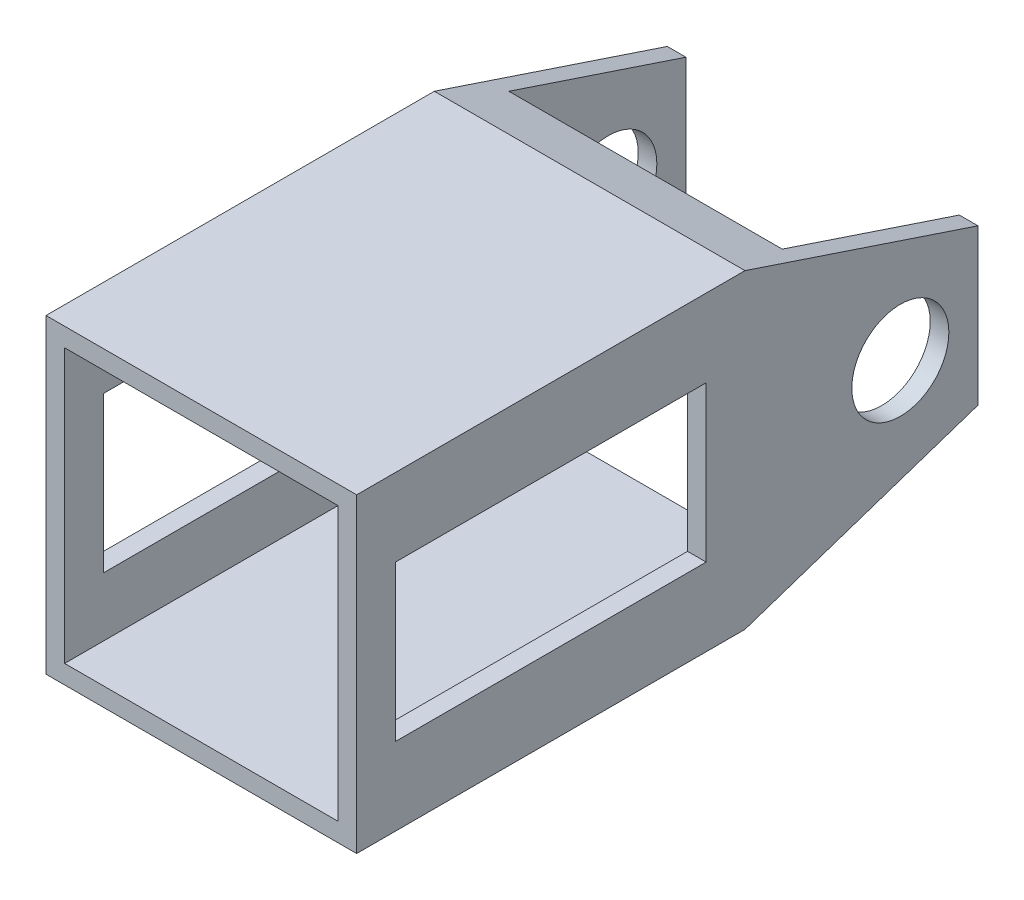
ISO-10303-21;
HEADER;
FILE_DESCRIPTION(('STEP AP214'),'2;1');
FILE_NAME('part.step','',(''),(''),'','','');
FILE_SCHEMA(('AUTOMOTIVE_DESIGN { 1 0 10303 214 1 1 1 1 }'));
ENDSEC;
DATA;
#1=APPLICATION_CONTEXT('core data for automotive mechanical design processes');
#2=APPLICATION_PROTOCOL_DEFINITION('international standard','automotive_design',2000,#1);
#3=PRODUCT_CONTEXT('',#1,'mechanical');
#4=PRODUCT('Part','Part','',(#3));
#5=PRODUCT_RELATED_PRODUCT_CATEGORY('part','',(#4));
#6=PRODUCT_DEFINITION_FORMATION('','',#4);
#7=PRODUCT_DEFINITION_CONTEXT('part definition',#1,'design');
#8=PRODUCT_DEFINITION('design','',#6,#7);
#9=PRODUCT_DEFINITION_SHAPE('','',#8);
#10=(LENGTH_UNIT() NAMED_UNIT(*) SI_UNIT(.MILLI.,.METRE.));
#11=(NAMED_UNIT(*) PLANE_ANGLE_UNIT() SI_UNIT($,.RADIAN.));
#12=(NAMED_UNIT(*) SI_UNIT($,.STERADIAN.) SOLID_ANGLE_UNIT());
#13=UNCERTAINTY_MEASURE_WITH_UNIT(LENGTH_MEASURE(1.E-05),#10,'distance_accuracy_value','');
#14=(GEOMETRIC_REPRESENTATION_CONTEXT(3) GLOBAL_UNCERTAINTY_ASSIGNED_CONTEXT((#13)) GLOBAL_UNIT_ASSIGNED_CONTEXT((#10,
#11,#12)) REPRESENTATION_CONTEXT('',''));
#15=CARTESIAN_POINT('',(0.,0.,0.));
#16=DIRECTION('',(0.,0.,1.));
#17=DIRECTION('',(1.,0.,0.));
#18=AXIS2_PLACEMENT_3D('',#15,#16,#17);
#19=CARTESIAN_POINT('',(0.,0.,-25.4));
#20=DIRECTION('',(0.,0.,-1.));
#21=DIRECTION('',(-1.,0.,0.));
#22=AXIS2_PLACEMENT_3D('',#19,#20,#21);
#23=PLANE('',#22);
#24=DIRECTION('',(1.,0.,0.));
#25=VECTOR('',#24,1.);
#26=CARTESIAN_POINT('',(-12.7,6.35,-25.4));
#27=LINE('',#26,#25);
#28=CARTESIAN_POINT('',(11.176,6.35,-25.4));
#29=VERTEX_POINT('',#28);
#30=CARTESIAN_POINT('',(12.7,6.35,-25.4));
#31=VERTEX_POINT('',#30);
#32=EDGE_CURVE('E200',#29,#31,#27,.T.);
#33=ORIENTED_EDGE('',*,*,#32,.T.);
#34=DIRECTION('',(0.,1.,0.));
#35=VECTOR('',#34,1.);
#36=CARTESIAN_POINT('',(12.7,-12.7,-25.4));
#37=LINE('',#36,#35);
#38=CARTESIAN_POINT('',(12.7,-6.35,-25.4));
#39=VERTEX_POINT('',#38);
#40=EDGE_CURVE('E277',#39,#31,#37,.T.);
#41=ORIENTED_EDGE('',*,*,#40,.F.);
#42=DIRECTION('',(1.,0.,0.));
#43=VECTOR('',#42,1.);
#44=CARTESIAN_POINT('',(-12.7,-6.35,-25.4));
#45=LINE('',#44,#43);
#46=CARTESIAN_POINT('',(11.176,-6.35,-25.4));
#47=VERTEX_POINT('',#46);
#48=EDGE_CURVE('E316',#47,#39,#45,.T.);
#49=ORIENTED_EDGE('',*,*,#48,.F.);
#50=DIRECTION('',(0.,1.,0.));
#51=VECTOR('',#50,1.);
#52=CARTESIAN_POINT('',(11.176,-11.176,-25.4));
#53=LINE('',#52,#51);
#54=EDGE_CURVE('E251',#47,#29,#53,.T.);
#55=ORIENTED_EDGE('',*,*,#54,.T.);
#56=EDGE_LOOP('',(#33,#41,#49,#55));
#57=FACE_BOUND('',#56,.T.);
#58=ADVANCED_FACE('F42',(#57),#23,.T.);
#59=CARTESIAN_POINT('',(0.,0.,25.4));
#60=DIRECTION('',(0.,0.,-1.));
#61=DIRECTION('',(-1.,0.,0.));
#62=AXIS2_PLACEMENT_3D('',#59,#60,#61);
#63=PLANE('',#62);
#64=DIRECTION('',(0.,1.,0.));
#65=VECTOR('',#64,1.);
#66=CARTESIAN_POINT('',(12.7,-12.7,25.4));
#67=LINE('',#66,#65);
#68=CARTESIAN_POINT('',(12.7,-12.7,25.4));
#69=VERTEX_POINT('',#68);
#70=CARTESIAN_POINT('',(12.7,12.7,25.4));
#71=VERTEX_POINT('',#70);
#72=EDGE_CURVE('E278',#69,#71,#67,.T.);
#73=ORIENTED_EDGE('',*,*,#72,.T.);
#74=DIRECTION('',(-1.,0.,0.));
#75=VECTOR('',#74,1.);
#76=CARTESIAN_POINT('',(-12.7,12.7,25.4));
#77=LINE('',#76,#75);
#78=CARTESIAN_POINT('',(-12.7,12.7,25.4));
#79=VERTEX_POINT('',#78);
#80=EDGE_CURVE('E282',#71,#79,#77,.T.);
#81=ORIENTED_EDGE('',*,*,#80,.T.);
#82=DIRECTION('',(0.,-1.,0.));
#83=VECTOR('',#82,1.);
#84=CARTESIAN_POINT('',(-12.7,-12.7,25.4));
#85=LINE('',#84,#83);
#86=CARTESIAN_POINT('',(-12.7,-12.7,25.4));
#87=VERTEX_POINT('',#86);
#88=EDGE_CURVE('E204',#79,#87,#85,.T.);
#89=ORIENTED_EDGE('',*,*,#88,.T.);
#90=DIRECTION('',(1.,0.,0.));
#91=VECTOR('',#90,1.);
#92=CARTESIAN_POINT('',(-12.7,-12.7,25.4));
#93=LINE('',#92,#91);
#94=EDGE_CURVE('E288',#87,#69,#93,.T.);
#95=ORIENTED_EDGE('',*,*,#94,.T.);
#96=EDGE_LOOP('',(#73,#81,#89,#95));
#97=FACE_BOUND('',#96,.T.);
#98=DIRECTION('',(0.,1.,0.));
#99=VECTOR('',#98,1.);
#100=CARTESIAN_POINT('',(11.176,-11.176,25.4));
#101=LINE('',#100,#99);
#102=CARTESIAN_POINT('',(11.176,-11.176,25.4));
#103=VERTEX_POINT('',#102);
#104=CARTESIAN_POINT('',(11.176,11.176,25.4));
#105=VERTEX_POINT('',#104);
#106=EDGE_CURVE('E402',#103,#105,#101,.T.);
#107=ORIENTED_EDGE('',*,*,#106,.F.);
#108=DIRECTION('',(1.,0.,0.));
#109=VECTOR('',#108,1.);
#110=CARTESIAN_POINT('',(-11.176,-11.176,25.4));
#111=LINE('',#110,#109);
#112=CARTESIAN_POINT('',(-11.176,-11.176,25.4));
#113=VERTEX_POINT('',#112);
#114=EDGE_CURVE('E256',#113,#103,#111,.T.);
#115=ORIENTED_EDGE('',*,*,#114,.F.);
#116=DIRECTION('',(0.,-1.,0.));
#117=VECTOR('',#116,1.);
#118=CARTESIAN_POINT('',(-11.176,-11.176,25.4));
#119=LINE('',#118,#117);
#120=CARTESIAN_POINT('',(-11.176,11.176,25.4));
#121=VERTEX_POINT('',#120);
#122=EDGE_CURVE('E264',#121,#113,#119,.T.);
#123=ORIENTED_EDGE('',*,*,#122,.F.);
#124=DIRECTION('',(-1.,0.,0.));
#125=VECTOR('',#124,1.);
#126=CARTESIAN_POINT('',(-11.176,11.176,25.4));
#127=LINE('',#126,#125);
#128=EDGE_CURVE('E405',#105,#121,#127,.T.);
#129=ORIENTED_EDGE('',*,*,#128,.F.);
#130=EDGE_LOOP('',(#107,#115,#123,#129));
#131=FACE_BOUND('',#130,.T.);
#132=ADVANCED_FACE('F426',(#97,#131),#63,.F.);
#133=CARTESIAN_POINT('',(-12.7,6.35,-25.4));
#134=VERTEX_POINT('',#133);
#135=CARTESIAN_POINT('',(-11.176,6.35,-25.4));
#136=VERTEX_POINT('',#135);
#137=EDGE_CURVE('E183',#134,#136,#27,.T.);
#138=ORIENTED_EDGE('',*,*,#137,.T.);
#139=DIRECTION('',(0.,-1.,0.));
#140=VECTOR('',#139,1.);
#141=CARTESIAN_POINT('',(-11.176,-11.176,-25.4));
#142=LINE('',#141,#140);
#143=CARTESIAN_POINT('',(-11.176,-6.35,-25.4));
#144=VERTEX_POINT('',#143);
#145=EDGE_CURVE('E267',#136,#144,#142,.T.);
#146=ORIENTED_EDGE('',*,*,#145,.T.);
#147=CARTESIAN_POINT('',(-12.7,-6.35,-25.4));
#148=VERTEX_POINT('',#147);
#149=EDGE_CURVE('E311',#148,#144,#45,.T.);
#150=ORIENTED_EDGE('',*,*,#149,.F.);
#151=DIRECTION('',(0.,-1.,0.));
#152=VECTOR('',#151,1.);
#153=CARTESIAN_POINT('',(-12.7,-12.7,-25.4));
#154=LINE('',#153,#152);
#155=EDGE_CURVE('E283',#134,#148,#154,.T.);
#156=ORIENTED_EDGE('',*,*,#155,.F.);
#157=EDGE_LOOP('',(#138,#146,#150,#156));
#158=FACE_BOUND('',#157,.T.);
#159=ADVANCED_FACE('F418',(#158),#23,.T.);
#160=CARTESIAN_POINT('',(12.7,-12.7,25.4));
#161=DIRECTION('',(-1.,0.,0.));
#162=DIRECTION('',(0.,0.,1.));
#163=AXIS2_PLACEMENT_3D('',#160,#161,#162);
#164=PLANE('',#163);
#165=DIRECTION('',(0.,0.,1.));
#166=VECTOR('',#165,1.);
#167=CARTESIAN_POINT('',(12.7,6.35,22.225));
#168=LINE('',#167,#166);
#169=CARTESIAN_POINT('',(12.7,6.35,-3.175));
#170=VERTEX_POINT('',#169);
#171=CARTESIAN_POINT('',(12.7,6.35,22.225));
#172=VERTEX_POINT('',#171);
#173=EDGE_CURVE('E351',#170,#172,#168,.T.);
#174=ORIENTED_EDGE('',*,*,#173,.F.);
#175=DIRECTION('',(0.,1.,0.));
#176=VECTOR('',#175,1.);
#177=CARTESIAN_POINT('',(12.7,-6.35,-3.175));
#178=LINE('',#177,#176);
#179=CARTESIAN_POINT('',(12.7,-6.35,-3.175));
#180=VERTEX_POINT('',#179);
#181=EDGE_CURVE('E348',#180,#170,#178,.T.);
#182=ORIENTED_EDGE('',*,*,#181,.F.);
#183=DIRECTION('',(0.,0.,-1.));
#184=VECTOR('',#183,1.);
#185=CARTESIAN_POINT('',(12.7,-6.35,22.225));
#186=LINE('',#185,#184);
#187=CARTESIAN_POINT('',(12.7,-6.35,22.225));
#188=VERTEX_POINT('',#187);
#189=EDGE_CURVE('E335',#188,#180,#186,.T.);
#190=ORIENTED_EDGE('',*,*,#189,.F.);
#191=DIRECTION('',(0.,-1.,0.));
#192=VECTOR('',#191,1.);
#193=CARTESIAN_POINT('',(12.7,-6.35,22.225));
#194=LINE('',#193,#192);
#195=EDGE_CURVE('E356',#172,#188,#194,.T.);
#196=ORIENTED_EDGE('',*,*,#195,.F.);
#197=EDGE_LOOP('',(#174,#182,#190,#196));
#198=FACE_BOUND('',#197,.T.);
#199=CARTESIAN_POINT('',(12.7,0.,-19.05));
#200=DIRECTION('',(1.,0.,0.));
#201=DIRECTION('',(0.,0.,-1.));
#202=AXIS2_PLACEMENT_3D('',#199,#200,#201);
#203=CIRCLE('',#202,3.96875);
#204=CARTESIAN_POINT('',(12.7,0.,-23.01875));
#205=VERTEX_POINT('',#204);
#206=EDGE_CURVE('E352',#205,#205,#203,.T.);
#207=ORIENTED_EDGE('',*,*,#206,.F.);
#208=EDGE_LOOP('',(#207));
#209=FACE_BOUND('',#208,.T.);
#210=ORIENTED_EDGE('',*,*,#40,.T.);
#211=DIRECTION('',(0.,-0.316227766016838,-0.948683298050514));
#212=VECTOR('',#211,1.);
#213=CARTESIAN_POINT('',(12.7,12.7,-6.35));
#214=LINE('',#213,#212);
#215=CARTESIAN_POINT('',(12.7,12.7,-6.35));
#216=VERTEX_POINT('',#215);
#217=EDGE_CURVE('E189',#216,#31,#214,.T.);
#218=ORIENTED_EDGE('',*,*,#217,.F.);
#219=DIRECTION('',(0.,0.,-1.));
#220=VECTOR('',#219,1.);
#221=CARTESIAN_POINT('',(12.7,12.7,25.4));
#222=LINE('',#221,#220);
#223=EDGE_CURVE('E198',#71,#216,#222,.T.);
#224=ORIENTED_EDGE('',*,*,#223,.F.);
#225=ORIENTED_EDGE('',*,*,#72,.F.);
#226=DIRECTION('',(0.,0.,-1.));
#227=VECTOR('',#226,1.);
#228=CARTESIAN_POINT('',(12.7,-12.7,25.4));
#229=LINE('',#228,#227);
#230=CARTESIAN_POINT('',(12.7,-12.7,-6.35));
#231=VERTEX_POINT('',#230);
#232=EDGE_CURVE('E213',#69,#231,#229,.T.);
#233=ORIENTED_EDGE('',*,*,#232,.T.);
#234=DIRECTION('',(0.,-0.316227766016838,0.948683298050514));
#235=VECTOR('',#234,1.);
#236=CARTESIAN_POINT('',(12.7,-12.7,-6.35));
#237=LINE('',#236,#235);
#238=EDGE_CURVE('E301',#39,#231,#237,.T.);
#239=ORIENTED_EDGE('',*,*,#238,.F.);
#240=EDGE_LOOP('',(#210,#218,#224,#225,#233,#239));
#241=FACE_BOUND('',#240,.T.);
#242=ADVANCED_FACE('F44',(#198,#209,#241),#164,.F.);
#243=CARTESIAN_POINT('',(-12.7,12.7,25.4));
#244=DIRECTION('',(0.,-1.,0.));
#245=DIRECTION('',(0.,0.,-1.));
#246=AXIS2_PLACEMENT_3D('',#243,#244,#245);
#247=PLANE('',#246);
#248=ORIENTED_EDGE('',*,*,#223,.T.);
#249=DIRECTION('',(1.,0.,0.));
#250=VECTOR('',#249,1.);
#251=CARTESIAN_POINT('',(-12.7,12.7,-6.35));
#252=LINE('',#251,#250);
#253=CARTESIAN_POINT('',(-12.7,12.7,-6.35));
#254=VERTEX_POINT('',#253);
#255=EDGE_CURVE('E180',#254,#216,#252,.T.);
#256=ORIENTED_EDGE('',*,*,#255,.F.);
#257=DIRECTION('',(0.,0.,-1.));
#258=VECTOR('',#257,1.);
#259=CARTESIAN_POINT('',(-12.7,12.7,25.4));
#260=LINE('',#259,#258);
#261=EDGE_CURVE('E195',#79,#254,#260,.T.);
#262=ORIENTED_EDGE('',*,*,#261,.F.);
#263=ORIENTED_EDGE('',*,*,#80,.F.);
#264=EDGE_LOOP('',(#248,#256,#262,#263));
#265=FACE_BOUND('',#264,.T.);
#266=ADVANCED_FACE('F194',(#265),#247,.F.);
#267=CARTESIAN_POINT('',(-12.7,-12.7,25.4));
#268=DIRECTION('',(1.,0.,0.));
#269=DIRECTION('',(0.,1.,0.));
#270=AXIS2_PLACEMENT_3D('',#267,#268,#269);
#271=PLANE('',#270);
#272=DIRECTION('',(0.,0.,-1.));
#273=VECTOR('',#272,1.);
#274=CARTESIAN_POINT('',(-12.7,-6.35,22.225));
#275=LINE('',#274,#273);
#276=CARTESIAN_POINT('',(-12.7,-6.35,22.225));
#277=VERTEX_POINT('',#276);
#278=CARTESIAN_POINT('',(-12.7,-6.35,-3.175));
#279=VERTEX_POINT('',#278);
#280=EDGE_CURVE('E343',#277,#279,#275,.T.);
#281=ORIENTED_EDGE('',*,*,#280,.T.);
#282=DIRECTION('',(0.,1.,0.));
#283=VECTOR('',#282,1.);
#284=CARTESIAN_POINT('',(-12.7,-6.35,-3.175));
#285=LINE('',#284,#283);
#286=CARTESIAN_POINT('',(-12.7,6.35,-3.175));
#287=VERTEX_POINT('',#286);
#288=EDGE_CURVE('E330',#279,#287,#285,.T.);
#289=ORIENTED_EDGE('',*,*,#288,.T.);
#290=DIRECTION('',(0.,0.,1.));
#291=VECTOR('',#290,1.);
#292=CARTESIAN_POINT('',(-12.7,6.35,22.225));
#293=LINE('',#292,#291);
#294=CARTESIAN_POINT('',(-12.7,6.35,22.225));
#295=VERTEX_POINT('',#294);
#296=EDGE_CURVE('E334',#287,#295,#293,.T.);
#297=ORIENTED_EDGE('',*,*,#296,.T.);
#298=DIRECTION('',(0.,-1.,0.));
#299=VECTOR('',#298,1.);
#300=CARTESIAN_POINT('',(-12.7,-6.35,22.225));
#301=LINE('',#300,#299);
#302=EDGE_CURVE('E339',#295,#277,#301,.T.);
#303=ORIENTED_EDGE('',*,*,#302,.T.);
#304=EDGE_LOOP('',(#281,#289,#297,#303));
#305=FACE_BOUND('',#304,.T.);
#306=CARTESIAN_POINT('',(-12.7,0.,-19.05));
#307=DIRECTION('',(1.,0.,0.));
#308=DIRECTION('',(0.,0.,-1.));
#309=AXIS2_PLACEMENT_3D('',#306,#307,#308);
#310=CIRCLE('',#309,3.96875);
#311=CARTESIAN_POINT('',(-12.7,0.,-23.01875));
#312=VERTEX_POINT('',#311);
#313=EDGE_CURVE('E329',#312,#312,#310,.T.);
#314=ORIENTED_EDGE('',*,*,#313,.T.);
#315=EDGE_LOOP('',(#314));
#316=FACE_BOUND('',#315,.T.);
#317=ORIENTED_EDGE('',*,*,#261,.T.);
#318=DIRECTION('',(0.,-0.316227766016838,-0.948683298050514));
#319=VECTOR('',#318,1.);
#320=CARTESIAN_POINT('',(-12.7,12.7,-6.35));
#321=LINE('',#320,#319);
#322=EDGE_CURVE('E177',#254,#134,#321,.T.);
#323=ORIENTED_EDGE('',*,*,#322,.T.);
#324=ORIENTED_EDGE('',*,*,#155,.T.);
#325=DIRECTION('',(0.,-0.316227766016838,0.948683298050514));
#326=VECTOR('',#325,1.);
#327=CARTESIAN_POINT('',(-12.7,-12.7,-6.35));
#328=LINE('',#327,#326);
#329=CARTESIAN_POINT('',(-12.7,-12.7,-6.35));
#330=VERTEX_POINT('',#329);
#331=EDGE_CURVE('E310',#148,#330,#328,.T.);
#332=ORIENTED_EDGE('',*,*,#331,.T.);
#333=DIRECTION('',(0.,0.,-1.));
#334=VECTOR('',#333,1.);
#335=CARTESIAN_POINT('',(-12.7,-12.7,25.4));
#336=LINE('',#335,#334);
#337=EDGE_CURVE('E206',#87,#330,#336,.T.);
#338=ORIENTED_EDGE('',*,*,#337,.F.);
#339=ORIENTED_EDGE('',*,*,#88,.F.);
#340=EDGE_LOOP('',(#317,#323,#324,#332,#338,#339));
#341=FACE_BOUND('',#340,.T.);
#342=ADVANCED_FACE('F202',(#305,#316,#341),#271,.F.);
#343=CARTESIAN_POINT('',(-12.7,-12.7,25.4));
#344=DIRECTION('',(0.,1.,0.));
#345=DIRECTION('',(0.,0.,1.));
#346=AXIS2_PLACEMENT_3D('',#343,#344,#345);
#347=PLANE('',#346);
#348=ORIENTED_EDGE('',*,*,#337,.T.);
#349=DIRECTION('',(1.,0.,0.));
#350=VECTOR('',#349,1.);
#351=CARTESIAN_POINT('',(-12.7,-12.7,-6.35));
#352=LINE('',#351,#350);
#353=EDGE_CURVE('E307',#330,#231,#352,.T.);
#354=ORIENTED_EDGE('',*,*,#353,.T.);
#355=ORIENTED_EDGE('',*,*,#232,.F.);
#356=ORIENTED_EDGE('',*,*,#94,.F.);
#357=EDGE_LOOP('',(#348,#354,#355,#356));
#358=FACE_BOUND('',#357,.T.);
#359=ADVANCED_FACE('F306',(#358),#347,.F.);
#360=CARTESIAN_POINT('',(11.176,-11.176,25.4));
#361=DIRECTION('',(-1.,0.,0.));
#362=DIRECTION('',(0.,0.,1.));
#363=AXIS2_PLACEMENT_3D('',#360,#361,#362);
#364=PLANE('',#363);
#365=DIRECTION('',(0.,0.316227766016838,0.948683298050514));
#366=VECTOR('',#365,1.);
#367=CARTESIAN_POINT('',(11.176,19.8374,15.0622));
#368=LINE('',#367,#366);
#369=CARTESIAN_POINT('',(11.176,11.176,-10.922));
#370=VERTEX_POINT('',#369);
#371=EDGE_CURVE('E326',#29,#370,#368,.T.);
#372=ORIENTED_EDGE('',*,*,#371,.F.);
#373=ORIENTED_EDGE('',*,*,#54,.F.);
#374=DIRECTION('',(0.,0.316227766016838,-0.948683298050514));
#375=VECTOR('',#374,1.);
#376=CARTESIAN_POINT('',(11.176,-22.0726,21.7678));
#377=LINE('',#376,#375);
#378=CARTESIAN_POINT('',(11.176,-11.176,-10.922));
#379=VERTEX_POINT('',#378);
#380=EDGE_CURVE('E237',#379,#47,#377,.T.);
#381=ORIENTED_EDGE('',*,*,#380,.F.);
#382=DIRECTION('',(0.,0.,-1.));
#383=VECTOR('',#382,1.);
#384=CARTESIAN_POINT('',(11.176,-11.176,25.4));
#385=LINE('',#384,#383);
#386=EDGE_CURVE('E248',#103,#379,#385,.T.);
#387=ORIENTED_EDGE('',*,*,#386,.F.);
#388=ORIENTED_EDGE('',*,*,#106,.T.);
#389=DIRECTION('',(0.,0.,-1.));
#390=VECTOR('',#389,1.);
#391=CARTESIAN_POINT('',(11.176,11.176,25.4));
#392=LINE('',#391,#390);
#393=EDGE_CURVE('E273',#105,#370,#392,.T.);
#394=ORIENTED_EDGE('',*,*,#393,.T.);
#395=EDGE_LOOP('',(#372,#373,#381,#387,#388,#394));
#396=FACE_BOUND('',#395,.T.);
#397=DIRECTION('',(0.,-1.,0.));
#398=VECTOR('',#397,1.);
#399=CARTESIAN_POINT('',(11.176,-11.176,-3.175));
#400=LINE('',#399,#398);
#401=CARTESIAN_POINT('',(11.176,6.35,-3.175));
#402=VERTEX_POINT('',#401);
#403=CARTESIAN_POINT('',(11.176,-6.35,-3.175));
#404=VERTEX_POINT('',#403);
#405=EDGE_CURVE('E399',#402,#404,#400,.T.);
#406=ORIENTED_EDGE('',*,*,#405,.F.);
#407=DIRECTION('',(0.,0.,-1.));
#408=VECTOR('',#407,1.);
#409=CARTESIAN_POINT('',(11.176,6.34999999999999,25.4));
#410=LINE('',#409,#408);
#411=CARTESIAN_POINT('',(11.176,6.34999999999999,22.225));
#412=VERTEX_POINT('',#411);
#413=EDGE_CURVE('E389',#412,#402,#410,.T.);
#414=ORIENTED_EDGE('',*,*,#413,.F.);
#415=DIRECTION('',(0.,1.,0.));
#416=VECTOR('',#415,1.);
#417=CARTESIAN_POINT('',(11.176,-11.176,22.225));
#418=LINE('',#417,#416);
#419=CARTESIAN_POINT('',(11.176,-6.35,22.225));
#420=VERTEX_POINT('',#419);
#421=EDGE_CURVE('E392',#420,#412,#418,.T.);
#422=ORIENTED_EDGE('',*,*,#421,.F.);
#423=DIRECTION('',(0.,0.,1.));
#424=VECTOR('',#423,1.);
#425=CARTESIAN_POINT('',(11.176,-6.35,25.4));
#426=LINE('',#425,#424);
#427=EDGE_CURVE('E396',#404,#420,#426,.T.);
#428=ORIENTED_EDGE('',*,*,#427,.F.);
#429=EDGE_LOOP('',(#406,#414,#422,#428));
#430=FACE_BOUND('',#429,.T.);
#431=CARTESIAN_POINT('',(11.176,0.,-19.05));
#432=DIRECTION('',(-1.,0.,0.));
#433=DIRECTION('',(0.,0.,1.));
#434=AXIS2_PLACEMENT_3D('',#431,#432,#433);
#435=CIRCLE('',#434,3.96875);
#436=CARTESIAN_POINT('',(11.176,0.,-15.08125));
#437=VERTEX_POINT('',#436);
#438=EDGE_CURVE('E221',#437,#437,#435,.T.);
#439=ORIENTED_EDGE('',*,*,#438,.F.);
#440=EDGE_LOOP('',(#439));
#441=FACE_BOUND('',#440,.T.);
#442=ADVANCED_FACE('F246',(#396,#430,#441),#364,.T.);
#443=CARTESIAN_POINT('',(-11.176,11.176,25.4));
#444=DIRECTION('',(0.,-1.,0.));
#445=DIRECTION('',(0.,0.,-1.));
#446=AXIS2_PLACEMENT_3D('',#443,#444,#445);
#447=PLANE('',#446);
#448=DIRECTION('',(-1.,0.,0.));
#449=VECTOR('',#448,1.);
#450=CARTESIAN_POINT('',(-11.176,11.176,-10.922));
#451=LINE('',#450,#449);
#452=CARTESIAN_POINT('',(-11.176,11.176,-10.922));
#453=VERTEX_POINT('',#452);
#454=EDGE_CURVE('E57',#370,#453,#451,.T.);
#455=ORIENTED_EDGE('',*,*,#454,.F.);
#456=ORIENTED_EDGE('',*,*,#393,.F.);
#457=ORIENTED_EDGE('',*,*,#128,.T.);
#458=DIRECTION('',(0.,0.,-1.));
#459=VECTOR('',#458,1.);
#460=CARTESIAN_POINT('',(-11.176,11.176,25.4));
#461=LINE('',#460,#459);
#462=EDGE_CURVE('E262',#121,#453,#461,.T.);
#463=ORIENTED_EDGE('',*,*,#462,.T.);
#464=EDGE_LOOP('',(#455,#456,#457,#463));
#465=FACE_BOUND('',#464,.T.);
#466=ADVANCED_FACE('F429',(#465),#447,.T.);
#467=CARTESIAN_POINT('',(-11.176,-11.176,25.4));
#468=DIRECTION('',(1.,0.,0.));
#469=DIRECTION('',(0.,0.,-1.));
#470=AXIS2_PLACEMENT_3D('',#467,#468,#469);
#471=PLANE('',#470);
#472=DIRECTION('',(0.,-0.316227766016838,-0.948683298050514));
#473=VECTOR('',#472,1.);
#474=CARTESIAN_POINT('',(-11.176,19.8374,15.0622));
#475=LINE('',#474,#473);
#476=EDGE_CURVE('E11',#453,#136,#475,.T.);
#477=ORIENTED_EDGE('',*,*,#476,.F.);
#478=ORIENTED_EDGE('',*,*,#462,.F.);
#479=ORIENTED_EDGE('',*,*,#122,.T.);
#480=DIRECTION('',(0.,0.,-1.));
#481=VECTOR('',#480,1.);
#482=CARTESIAN_POINT('',(-11.176,-11.176,25.4));
#483=LINE('',#482,#481);
#484=CARTESIAN_POINT('',(-11.176,-11.176,-10.922));
#485=VERTEX_POINT('',#484);
#486=EDGE_CURVE('E258',#113,#485,#483,.T.);
#487=ORIENTED_EDGE('',*,*,#486,.T.);
#488=DIRECTION('',(0.,-0.316227766016838,0.948683298050514));
#489=VECTOR('',#488,1.);
#490=CARTESIAN_POINT('',(-11.176,-22.0726,21.7678));
#491=LINE('',#490,#489);
#492=EDGE_CURVE('E65',#144,#485,#491,.T.);
#493=ORIENTED_EDGE('',*,*,#492,.F.);
#494=ORIENTED_EDGE('',*,*,#145,.F.);
#495=EDGE_LOOP('',(#477,#478,#479,#487,#493,#494));
#496=FACE_BOUND('',#495,.T.);
#497=DIRECTION('',(0.,1.,0.));
#498=VECTOR('',#497,1.);
#499=CARTESIAN_POINT('',(-11.176,-11.176,-3.175));
#500=LINE('',#499,#498);
#501=CARTESIAN_POINT('',(-11.176,-6.35,-3.175));
#502=VERTEX_POINT('',#501);
#503=CARTESIAN_POINT('',(-11.176,6.34999999999999,-3.175));
#504=VERTEX_POINT('',#503);
#505=EDGE_CURVE('E231',#502,#504,#500,.T.);
#506=ORIENTED_EDGE('',*,*,#505,.F.);
#507=DIRECTION('',(0.,0.,-1.));
#508=VECTOR('',#507,1.);
#509=CARTESIAN_POINT('',(-11.176,-6.35,25.4));
#510=LINE('',#509,#508);
#511=CARTESIAN_POINT('',(-11.176,-6.35,22.225));
#512=VERTEX_POINT('',#511);
#513=EDGE_CURVE('E228',#512,#502,#510,.T.);
#514=ORIENTED_EDGE('',*,*,#513,.F.);
#515=DIRECTION('',(0.,-1.,0.));
#516=VECTOR('',#515,1.);
#517=CARTESIAN_POINT('',(-11.176,-11.176,22.225));
#518=LINE('',#517,#516);
#519=CARTESIAN_POINT('',(-11.176,6.35,22.225));
#520=VERTEX_POINT('',#519);
#521=EDGE_CURVE('E225',#520,#512,#518,.T.);
#522=ORIENTED_EDGE('',*,*,#521,.F.);
#523=DIRECTION('',(0.,0.,1.));
#524=VECTOR('',#523,1.);
#525=CARTESIAN_POINT('',(-11.176,6.34999999999999,25.4));
#526=LINE('',#525,#524);
#527=EDGE_CURVE('E210',#504,#520,#526,.T.);
#528=ORIENTED_EDGE('',*,*,#527,.F.);
#529=EDGE_LOOP('',(#506,#514,#522,#528));
#530=FACE_BOUND('',#529,.T.);
#531=CARTESIAN_POINT('',(-11.176,0.,-19.05));
#532=DIRECTION('',(1.,0.,0.));
#533=DIRECTION('',(0.,0.,-1.));
#534=AXIS2_PLACEMENT_3D('',#531,#532,#533);
#535=CIRCLE('',#534,3.96875);
#536=CARTESIAN_POINT('',(-11.176,0.,-23.01875));
#537=VERTEX_POINT('',#536);
#538=EDGE_CURVE('E217',#537,#537,#535,.T.);
#539=ORIENTED_EDGE('',*,*,#538,.F.);
#540=EDGE_LOOP('',(#539));
#541=FACE_BOUND('',#540,.T.);
#542=ADVANCED_FACE('F420',(#496,#530,#541),#471,.T.);
#543=CARTESIAN_POINT('',(-11.176,-11.176,25.4));
#544=DIRECTION('',(0.,1.,0.));
#545=DIRECTION('',(0.,0.,1.));
#546=AXIS2_PLACEMENT_3D('',#543,#544,#545);
#547=PLANE('',#546);
#548=DIRECTION('',(1.,0.,0.));
#549=VECTOR('',#548,1.);
#550=CARTESIAN_POINT('',(-11.176,-11.176,-10.922));
#551=LINE('',#550,#549);
#552=EDGE_CURVE('E51',#485,#379,#551,.T.);
#553=ORIENTED_EDGE('',*,*,#552,.F.);
#554=ORIENTED_EDGE('',*,*,#486,.F.);
#555=ORIENTED_EDGE('',*,*,#114,.T.);
#556=ORIENTED_EDGE('',*,*,#386,.T.);
#557=EDGE_LOOP('',(#553,#554,#555,#556));
#558=FACE_BOUND('',#557,.T.);
#559=ADVANCED_FACE('F254',(#558),#547,.T.);
#560=CARTESIAN_POINT('',(-12.7,0.,-19.05));
#561=DIRECTION('',(1.,0.,0.));
#562=DIRECTION('',(0.,0.,-1.));
#563=AXIS2_PLACEMENT_3D('',#560,#561,#562);
#564=CYLINDRICAL_SURFACE('',#563,3.96875);
#565=ORIENTED_EDGE('',*,*,#538,.T.);
#566=EDGE_LOOP('',(#565));
#567=FACE_BOUND('',#566,.T.);
#568=ORIENTED_EDGE('',*,*,#313,.F.);
#569=EDGE_LOOP('',(#568));
#570=FACE_BOUND('',#569,.T.);
#571=ADVANCED_FACE('F467',(#567,#570),#564,.F.);
#572=CARTESIAN_POINT('',(-12.7,6.35,22.225));
#573=DIRECTION('',(0.,1.,0.));
#574=DIRECTION('',(0.,0.,1.));
#575=AXIS2_PLACEMENT_3D('',#572,#573,#574);
#576=PLANE('',#575);
#577=ORIENTED_EDGE('',*,*,#527,.T.);
#578=DIRECTION('',(1.,0.,0.));
#579=VECTOR('',#578,1.);
#580=CARTESIAN_POINT('',(-12.7,6.35,22.225));
#581=LINE('',#580,#579);
#582=EDGE_CURVE('E372',#295,#520,#581,.T.);
#583=ORIENTED_EDGE('',*,*,#582,.F.);
#584=ORIENTED_EDGE('',*,*,#296,.F.);
#585=DIRECTION('',(1.,0.,0.));
#586=VECTOR('',#585,1.);
#587=CARTESIAN_POINT('',(-12.7,6.35,-3.175));
#588=LINE('',#587,#586);
#589=EDGE_CURVE('E377',#287,#504,#588,.T.);
#590=ORIENTED_EDGE('',*,*,#589,.T.);
#591=EDGE_LOOP('',(#577,#583,#584,#590));
#592=FACE_BOUND('',#591,.T.);
#593=ADVANCED_FACE('F479',(#592),#576,.F.);
#594=CARTESIAN_POINT('',(-12.7,-6.35,22.225));
#595=DIRECTION('',(0.,0.,1.));
#596=DIRECTION('',(1.,0.,0.));
#597=AXIS2_PLACEMENT_3D('',#594,#595,#596);
#598=PLANE('',#597);
#599=ORIENTED_EDGE('',*,*,#521,.T.);
#600=DIRECTION('',(1.,0.,0.));
#601=VECTOR('',#600,1.);
#602=CARTESIAN_POINT('',(-12.7,-6.35,22.225));
#603=LINE('',#602,#601);
#604=EDGE_CURVE('E367',#277,#512,#603,.T.);
#605=ORIENTED_EDGE('',*,*,#604,.F.);
#606=ORIENTED_EDGE('',*,*,#302,.F.);
#607=ORIENTED_EDGE('',*,*,#582,.T.);
#608=EDGE_LOOP('',(#599,#605,#606,#607));
#609=FACE_BOUND('',#608,.T.);
#610=ADVANCED_FACE('F485',(#609),#598,.F.);
#611=CARTESIAN_POINT('',(-12.7,-6.35,22.225));
#612=DIRECTION('',(0.,-1.,0.));
#613=DIRECTION('',(0.,0.,-1.));
#614=AXIS2_PLACEMENT_3D('',#611,#612,#613);
#615=PLANE('',#614);
#616=ORIENTED_EDGE('',*,*,#513,.T.);
#617=DIRECTION('',(1.,0.,0.));
#618=VECTOR('',#617,1.);
#619=CARTESIAN_POINT('',(-12.7,-6.35,-3.175));
#620=LINE('',#619,#618);
#621=EDGE_CURVE('E222',#279,#502,#620,.T.);
#622=ORIENTED_EDGE('',*,*,#621,.F.);
#623=ORIENTED_EDGE('',*,*,#280,.F.);
#624=ORIENTED_EDGE('',*,*,#604,.T.);
#625=EDGE_LOOP('',(#616,#622,#623,#624));
#626=FACE_BOUND('',#625,.T.);
#627=ADVANCED_FACE('F475',(#626),#615,.F.);
#628=CARTESIAN_POINT('',(-12.7,-6.35,-3.175));
#629=DIRECTION('',(0.,0.,-1.));
#630=DIRECTION('',(-1.,0.,0.));
#631=AXIS2_PLACEMENT_3D('',#628,#629,#630);
#632=PLANE('',#631);
#633=ORIENTED_EDGE('',*,*,#505,.T.);
#634=ORIENTED_EDGE('',*,*,#589,.F.);
#635=ORIENTED_EDGE('',*,*,#288,.F.);
#636=ORIENTED_EDGE('',*,*,#621,.T.);
#637=EDGE_LOOP('',(#633,#634,#635,#636));
#638=FACE_BOUND('',#637,.T.);
#639=ADVANCED_FACE('F464',(#638),#632,.F.);
#640=ORIENTED_EDGE('',*,*,#438,.T.);
#641=EDGE_LOOP('',(#640));
#642=FACE_BOUND('',#641,.T.);
#643=ORIENTED_EDGE('',*,*,#206,.T.);
#644=EDGE_LOOP('',(#643));
#645=FACE_BOUND('',#644,.T.);
#646=ADVANCED_FACE('F461',(#642,#645),#564,.F.);
#647=ORIENTED_EDGE('',*,*,#405,.T.);
#648=EDGE_CURVE('E366',#404,#180,#620,.T.);
#649=ORIENTED_EDGE('',*,*,#648,.T.);
#650=ORIENTED_EDGE('',*,*,#181,.T.);
#651=EDGE_CURVE('E347',#402,#170,#588,.T.);
#652=ORIENTED_EDGE('',*,*,#651,.F.);
#653=EDGE_LOOP('',(#647,#649,#650,#652));
#654=FACE_BOUND('',#653,.T.);
#655=ADVANCED_FACE('F463',(#654),#632,.F.);
#656=ORIENTED_EDGE('',*,*,#427,.T.);
#657=EDGE_CURVE('E371',#420,#188,#603,.T.);
#658=ORIENTED_EDGE('',*,*,#657,.T.);
#659=ORIENTED_EDGE('',*,*,#189,.T.);
#660=ORIENTED_EDGE('',*,*,#648,.F.);
#661=EDGE_LOOP('',(#656,#658,#659,#660));
#662=FACE_BOUND('',#661,.T.);
#663=ADVANCED_FACE('F472',(#662),#615,.F.);
#664=ORIENTED_EDGE('',*,*,#421,.T.);
#665=EDGE_CURVE('E376',#412,#172,#581,.T.);
#666=ORIENTED_EDGE('',*,*,#665,.T.);
#667=ORIENTED_EDGE('',*,*,#195,.T.);
#668=ORIENTED_EDGE('',*,*,#657,.F.);
#669=EDGE_LOOP('',(#664,#666,#667,#668));
#670=FACE_BOUND('',#669,.T.);
#671=ADVANCED_FACE('F513',(#670),#598,.F.);
#672=ORIENTED_EDGE('',*,*,#413,.T.);
#673=ORIENTED_EDGE('',*,*,#651,.T.);
#674=ORIENTED_EDGE('',*,*,#173,.T.);
#675=ORIENTED_EDGE('',*,*,#665,.F.);
#676=EDGE_LOOP('',(#672,#673,#674,#675));
#677=FACE_BOUND('',#676,.T.);
#678=ADVANCED_FACE('F488',(#677),#576,.F.);
#679=CARTESIAN_POINT('',(-12.7,-12.7,-6.35));
#680=DIRECTION('',(0.,0.948683298050514,0.316227766016838));
#681=DIRECTION('',(0.,-0.316227766016838,0.948683298050514));
#682=AXIS2_PLACEMENT_3D('',#679,#680,#681);
#683=PLANE('',#682);
#684=ORIENTED_EDGE('',*,*,#380,.T.);
#685=ORIENTED_EDGE('',*,*,#48,.T.);
#686=ORIENTED_EDGE('',*,*,#238,.T.);
#687=ORIENTED_EDGE('',*,*,#353,.F.);
#688=ORIENTED_EDGE('',*,*,#331,.F.);
#689=ORIENTED_EDGE('',*,*,#149,.T.);
#690=ORIENTED_EDGE('',*,*,#492,.T.);
#691=ORIENTED_EDGE('',*,*,#552,.T.);
#692=EDGE_LOOP('',(#684,#685,#686,#687,#688,#689,#690,#691));
#693=FACE_BOUND('',#692,.T.);
#694=ADVANCED_FACE('F236',(#693),#683,.F.);
#695=CARTESIAN_POINT('',(-12.7,12.7,-6.35));
#696=DIRECTION('',(0.,-0.948683298050514,0.316227766016838));
#697=DIRECTION('',(0.,-0.316227766016838,-0.948683298050514));
#698=AXIS2_PLACEMENT_3D('',#695,#696,#697);
#699=PLANE('',#698);
#700=ORIENTED_EDGE('',*,*,#371,.T.);
#701=ORIENTED_EDGE('',*,*,#454,.T.);
#702=ORIENTED_EDGE('',*,*,#476,.T.);
#703=ORIENTED_EDGE('',*,*,#137,.F.);
#704=ORIENTED_EDGE('',*,*,#322,.F.);
#705=ORIENTED_EDGE('',*,*,#255,.T.);
#706=ORIENTED_EDGE('',*,*,#217,.T.);
#707=ORIENTED_EDGE('',*,*,#32,.F.);
#708=EDGE_LOOP('',(#700,#701,#702,#703,#704,#705,#706,#707));
#709=FACE_BOUND('',#708,.T.);
#710=ADVANCED_FACE('F179',(#709),#699,.F.);
#711=CLOSED_SHELL('',(#58,#132,#159,#242,#266,#342,#359,#442,#466,#542,#559,#571,#593,#610,#627,
#639,#646,#655,#663,#671,#678,#694,#710));
#712=MANIFOLD_SOLID_BREP('B2',#711);
#713=ADVANCED_BREP_SHAPE_REPRESENTATION('',(#18,#712),#14);
#714=SHAPE_DEFINITION_REPRESENTATION(#9,#713);
ENDSEC;
END-ISO-10303-21;
